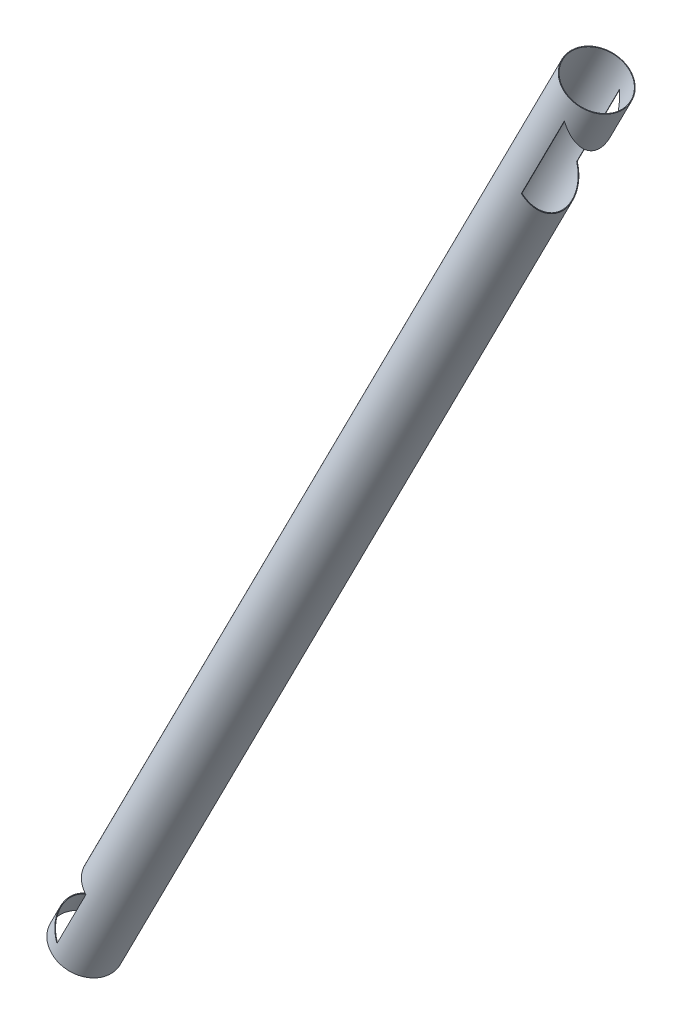
ISO-10303-21;
HEADER;
FILE_DESCRIPTION(('STEP AP214'),'2;1');
FILE_NAME('part.step','',(''),(''),'','','');
FILE_SCHEMA(('AUTOMOTIVE_DESIGN { 1 0 10303 214 1 1 1 1 }'));
ENDSEC;
DATA;
#1=APPLICATION_CONTEXT('core data for automotive mechanical design processes');
#2=APPLICATION_PROTOCOL_DEFINITION('international standard','automotive_design',2000,#1);
#3=PRODUCT_CONTEXT('',#1,'mechanical');
#4=PRODUCT('Part','Part','',(#3));
#5=PRODUCT_RELATED_PRODUCT_CATEGORY('part','',(#4));
#6=PRODUCT_DEFINITION_FORMATION('','',#4);
#7=PRODUCT_DEFINITION_CONTEXT('part definition',#1,'design');
#8=PRODUCT_DEFINITION('design','',#6,#7);
#9=PRODUCT_DEFINITION_SHAPE('','',#8);
#10=(LENGTH_UNIT() NAMED_UNIT(*) SI_UNIT(.MILLI.,.METRE.));
#11=(NAMED_UNIT(*) PLANE_ANGLE_UNIT() SI_UNIT($,.RADIAN.));
#12=(NAMED_UNIT(*) SI_UNIT($,.STERADIAN.) SOLID_ANGLE_UNIT());
#13=UNCERTAINTY_MEASURE_WITH_UNIT(LENGTH_MEASURE(1.E-05),#10,'distance_accuracy_value','');
#14=(GEOMETRIC_REPRESENTATION_CONTEXT(3) GLOBAL_UNCERTAINTY_ASSIGNED_CONTEXT((#13)) GLOBAL_UNIT_ASSIGNED_CONTEXT((#10,
#11,#12)) REPRESENTATION_CONTEXT('',''));
#15=CARTESIAN_POINT('',(0.,0.,0.));
#16=DIRECTION('',(0.,0.,1.));
#17=DIRECTION('',(1.,0.,0.));
#18=AXIS2_PLACEMENT_3D('',#15,#16,#17);
#19=CARTESIAN_POINT('',(1815.96199895819,3564.02609675347,0.));
#20=DIRECTION('',(0.453990499739548,0.891006524188367,0.));
#21=DIRECTION('',(-0.891006524188367,0.453990499739548,0.));
#22=AXIS2_PLACEMENT_3D('',#19,#20,#21);
#23=PLANE('',#22);
#24=CARTESIAN_POINT('',(1815.96199895819,3564.02609675347,0.));
#25=DIRECTION('',(0.453990499739548,0.891006524188367,0.));
#26=DIRECTION('',(-0.891006524188367,0.453990499739548,0.));
#27=AXIS2_PLACEMENT_3D('',#24,#25,#26);
#28=CIRCLE('',#27,102.);
#29=CARTESIAN_POINT('',(1725.07933349098,3610.3331277269,0.));
#30=VERTEX_POINT('',#29);
#31=EDGE_CURVE('E166',#30,#30,#28,.T.);
#32=ORIENTED_EDGE('',*,*,#31,.T.);
#33=EDGE_LOOP('',(#32));
#34=FACE_BOUND('',#33,.T.);
#35=CARTESIAN_POINT('',(1815.96199895819,3564.02609675347,0.));
#36=DIRECTION('',(0.453990499739548,0.891006524188367,0.));
#37=DIRECTION('',(-0.891006524188367,0.453990499739548,0.));
#38=AXIS2_PLACEMENT_3D('',#35,#36,#37);
#39=CIRCLE('',#38,100.);
#40=CARTESIAN_POINT('',(1726.86134653935,3609.42514672742,0.));
#41=VERTEX_POINT('',#40);
#42=EDGE_CURVE('E160',#41,#41,#39,.T.);
#43=ORIENTED_EDGE('',*,*,#42,.F.);
#44=EDGE_LOOP('',(#43));
#45=FACE_BOUND('',#44,.T.);
#46=ADVANCED_FACE('F55',(#34,#45),#23,.T.);
#47=CARTESIAN_POINT('',(0.,0.,0.));
#48=DIRECTION('',(0.453990499739548,0.891006524188367,0.));
#49=DIRECTION('',(-0.891006524188367,0.453990499739548,0.));
#50=AXIS2_PLACEMENT_3D('',#47,#48,#49);
#51=PLANE('',#50);
#52=CARTESIAN_POINT('',(0.,0.,0.));
#53=DIRECTION('',(0.453990499739548,0.891006524188367,0.));
#54=DIRECTION('',(-0.891006524188367,0.453990499739548,0.));
#55=AXIS2_PLACEMENT_3D('',#52,#53,#54);
#56=CIRCLE('',#55,102.);
#57=CARTESIAN_POINT('',(-90.8826654672135,46.3070309734339,0.));
#58=VERTEX_POINT('',#57);
#59=EDGE_CURVE('E163',#58,#58,#56,.T.);
#60=ORIENTED_EDGE('',*,*,#59,.F.);
#61=EDGE_LOOP('',(#60));
#62=FACE_BOUND('',#61,.T.);
#63=CARTESIAN_POINT('',(0.,0.,0.));
#64=DIRECTION('',(0.453990499739548,0.891006524188367,0.));
#65=DIRECTION('',(-0.891006524188367,0.453990499739548,0.));
#66=AXIS2_PLACEMENT_3D('',#63,#64,#65);
#67=CIRCLE('',#66,100.);
#68=CARTESIAN_POINT('',(-89.1006524188367,45.3990499739548,0.));
#69=VERTEX_POINT('',#68);
#70=EDGE_CURVE('E159',#69,#69,#67,.T.);
#71=ORIENTED_EDGE('',*,*,#70,.T.);
#72=EDGE_LOOP('',(#71));
#73=FACE_BOUND('',#72,.T.);
#74=ADVANCED_FACE('F206',(#62,#73),#51,.F.);
#75=CARTESIAN_POINT('',(1815.96199895819,3564.02609675347,0.));
#76=DIRECTION('',(-0.453990499739548,-0.891006524188367,0.));
#77=DIRECTION('',(0.891006524188367,-0.453990499739548,0.));
#78=AXIS2_PLACEMENT_3D('',#75,#76,#77);
#79=CYLINDRICAL_SURFACE('',#78,102.);
#80=CARTESIAN_POINT('',(1791.89509429515,3516.79213682679,0.));
#81=DIRECTION('',(0.977585011989273,0.210541075170458,0.));
#82=DIRECTION('',(0.210541075170458,-0.977585011989273,0.));
#83=AXIS2_PLACEMENT_3D('',#80,#81,#82);
#84=ELLIPSE('',#83,161.543780860049,102.);
#85=CARTESIAN_POINT('',(1799.897824015,3479.63383589765,99.1362698511497));
#86=VERTEX_POINT('',#85);
#87=CARTESIAN_POINT('',(1799.897824015,3479.63383589765,-99.13626985115));
#88=VERTEX_POINT('',#87);
#89=EDGE_CURVE('E126',#86,#88,#84,.T.);
#90=ORIENTED_EDGE('',*,*,#89,.T.);
#91=DIRECTION('',(-0.453990499739548,-0.891006524188367,0.));
#92=VECTOR('',#91,1.);
#93=CARTESIAN_POINT('',(1837.34615553871,3553.13032475972,-99.1362698511499));
#94=LINE('',#93,#92);
#95=CARTESIAN_POINT('',(1647.60708736431,3180.74643625588,-99.13626985115));
#96=VERTEX_POINT('',#95);
#97=EDGE_CURVE('E133',#88,#96,#94,.T.);
#98=ORIENTED_EDGE('',*,*,#97,.T.);
#99=CARTESIAN_POINT('',(1632.97481507119,3204.89352728403,0.));
#100=DIRECTION('',(-0.855234381676339,-0.518241403593624,0.));
#101=DIRECTION('',(0.518241403593624,-0.85523438167634,0.));
#102=AXIS2_PLACEMENT_3D('',#99,#100,#101);
#103=ELLIPSE('',#102,119.996505131697,102.);
#104=CARTESIAN_POINT('',(1647.60708736431,3180.74643625588,99.1362698511497));
#105=VERTEX_POINT('',#104);
#106=EDGE_CURVE('E118',#96,#105,#103,.T.);
#107=ORIENTED_EDGE('',*,*,#106,.T.);
#108=DIRECTION('',(-0.453990499739548,-0.891006524188367,0.));
#109=VECTOR('',#108,1.);
#110=CARTESIAN_POINT('',(1837.34615553871,3553.13032475972,99.1362698511499));
#111=LINE('',#110,#109);
#112=EDGE_CURVE('E140',#105,#86,#111,.F.);
#113=ORIENTED_EDGE('',*,*,#112,.T.);
#114=EDGE_LOOP('',(#90,#98,#107,#113));
#115=FACE_BOUND('',#114,.T.);
#116=CARTESIAN_POINT('',(122.663003232666,240.739698781241,0.));
#117=DIRECTION('',(0.453990499739548,0.891006524188367,0.));
#118=DIRECTION('',(-0.891006524188367,0.453990499739548,0.));
#119=AXIS2_PLACEMENT_3D('',#116,#117,#118);
#120=CIRCLE('',#119,102.);
#121=CARTESIAN_POINT('',(101.278846652145,251.63547077499,-99.1362698511497));
#122=VERTEX_POINT('',#121);
#123=CARTESIAN_POINT('',(101.278846652145,251.63547077499,99.1362698511497));
#124=VERTEX_POINT('',#123);
#125=EDGE_CURVE('E157',#122,#124,#120,.T.);
#126=ORIENTED_EDGE('',*,*,#125,.T.);
#127=DIRECTION('',(-0.453990499739548,-0.891006524188367,0.));
#128=VECTOR('',#127,1.);
#129=CARTESIAN_POINT('',(1794.57784237767,3574.92186874722,99.1362698511497));
#130=LINE('',#129,#128);
#131=CARTESIAN_POINT('',(-1.43999708746469,50.0383889382912,99.1362698511499));
#132=VERTEX_POINT('',#131);
#133=EDGE_CURVE('E155',#124,#132,#130,.T.);
#134=ORIENTED_EDGE('',*,*,#133,.T.);
#135=CARTESIAN_POINT('',(14.6299364141214,28.7128669012269,0.));
#136=DIRECTION('',(-0.798635510047292,-0.60181502315205,0.));
#137=DIRECTION('',(0.60181502315205,-0.798635510047292,0.));
#138=AXIS2_PLACEMENT_3D('',#135,#136,#137);
#139=ELLIPSE('',#138,113.485397928469,102.);
#140=CARTESIAN_POINT('',(-1.43999708746469,50.0383889382912,-99.1362698511498));
#141=VERTEX_POINT('',#140);
#142=EDGE_CURVE('E78',#132,#141,#139,.T.);
#143=ORIENTED_EDGE('',*,*,#142,.T.);
#144=DIRECTION('',(-0.453990499739548,-0.891006524188367,0.));
#145=VECTOR('',#144,1.);
#146=CARTESIAN_POINT('',(1794.57784237767,3574.92186874722,-99.1362698511497));
#147=LINE('',#146,#145);
#148=EDGE_CURVE('E153',#141,#122,#147,.F.);
#149=ORIENTED_EDGE('',*,*,#148,.T.);
#150=EDGE_LOOP('',(#126,#134,#143,#149));
#151=FACE_BOUND('',#150,.T.);
#152=ORIENTED_EDGE('',*,*,#31,.F.);
#153=EDGE_LOOP('',(#152));
#154=FACE_BOUND('',#153,.T.);
#155=ORIENTED_EDGE('',*,*,#59,.T.);
#156=EDGE_LOOP('',(#155));
#157=FACE_BOUND('',#156,.T.);
#158=ADVANCED_FACE('F57',(#115,#151,#154,#157),#79,.T.);
#159=CARTESIAN_POINT('',(1815.96199895819,3564.02609675347,0.));
#160=DIRECTION('',(-0.453990499739548,-0.891006524188367,0.));
#161=DIRECTION('',(0.891006524188367,-0.453990499739548,0.));
#162=AXIS2_PLACEMENT_3D('',#159,#160,#161);
#163=CYLINDRICAL_SURFACE('',#162,100.);
#164=CARTESIAN_POINT('',(1791.89509429515,3516.79213682679,0.));
#165=DIRECTION('',(0.977585011989273,0.210541075170458,0.));
#166=DIRECTION('',(0.210541075170458,-0.977585011989273,0.));
#167=AXIS2_PLACEMENT_3D('',#164,#165,#166);
#168=ELLIPSE('',#167,158.376255745146,100.);
#169=CARTESIAN_POINT('',(1799.897824015,3479.63383589765,97.0772887960927));
#170=VERTEX_POINT('',#169);
#171=CARTESIAN_POINT('',(1799.897824015,3479.63383589765,-97.077288796093));
#172=VERTEX_POINT('',#171);
#173=EDGE_CURVE('E13',#170,#172,#168,.T.);
#174=ORIENTED_EDGE('',*,*,#173,.F.);
#175=DIRECTION('',(-0.453990499739548,-0.891006524188367,0.));
#176=VECTOR('',#175,1.);
#177=CARTESIAN_POINT('',(1837.34615553871,3553.13032475972,97.0772887960928));
#178=LINE('',#177,#176);
#179=CARTESIAN_POINT('',(1647.60708736431,3180.74643625588,97.0772887960926));
#180=VERTEX_POINT('',#179);
#181=EDGE_CURVE('E182',#180,#170,#178,.F.);
#182=ORIENTED_EDGE('',*,*,#181,.F.);
#183=CARTESIAN_POINT('',(1632.97481507119,3204.89352728403,0.));
#184=DIRECTION('',(-0.855234381676339,-0.518241403593624,0.));
#185=DIRECTION('',(0.518241403593624,-0.85523438167634,0.));
#186=AXIS2_PLACEMENT_3D('',#183,#184,#185);
#187=ELLIPSE('',#186,117.643632482056,100.);
#188=CARTESIAN_POINT('',(1647.60708736431,3180.74643625588,-97.077288796093));
#189=VERTEX_POINT('',#188);
#190=EDGE_CURVE('E180',#189,#180,#187,.T.);
#191=ORIENTED_EDGE('',*,*,#190,.F.);
#192=DIRECTION('',(-0.453990499739548,-0.891006524188367,0.));
#193=VECTOR('',#192,1.);
#194=CARTESIAN_POINT('',(1837.34615553871,3553.13032475972,-97.0772887960928));
#195=LINE('',#194,#193);
#196=EDGE_CURVE('E63',#172,#189,#195,.T.);
#197=ORIENTED_EDGE('',*,*,#196,.F.);
#198=EDGE_LOOP('',(#174,#182,#191,#197));
#199=FACE_BOUND('',#198,.T.);
#200=CARTESIAN_POINT('',(122.663003232666,240.739698781241,0.));
#201=DIRECTION('',(0.453990499739548,0.891006524188367,0.));
#202=DIRECTION('',(-0.891006524188367,0.453990499739548,0.));
#203=AXIS2_PLACEMENT_3D('',#200,#201,#202);
#204=CIRCLE('',#203,100.);
#205=CARTESIAN_POINT('',(101.278846652145,251.63547077499,-97.0772887960926));
#206=VERTEX_POINT('',#205);
#207=CARTESIAN_POINT('',(101.278846652145,251.63547077499,97.0772887960927));
#208=VERTEX_POINT('',#207);
#209=EDGE_CURVE('E178',#206,#208,#204,.T.);
#210=ORIENTED_EDGE('',*,*,#209,.F.);
#211=DIRECTION('',(-0.453990499739548,-0.891006524188367,0.));
#212=VECTOR('',#211,1.);
#213=CARTESIAN_POINT('',(1794.57784237767,3574.92186874722,-97.0772887960926));
#214=LINE('',#213,#212);
#215=CARTESIAN_POINT('',(-1.43999708746469,50.0383889382912,-97.0772887960928));
#216=VERTEX_POINT('',#215);
#217=EDGE_CURVE('E173',#216,#206,#214,.F.);
#218=ORIENTED_EDGE('',*,*,#217,.F.);
#219=CARTESIAN_POINT('',(14.6299364141214,28.7128669012269,0.));
#220=DIRECTION('',(-0.798635510047292,-0.60181502315205,0.));
#221=DIRECTION('',(0.60181502315205,-0.798635510047292,0.));
#222=AXIS2_PLACEMENT_3D('',#219,#220,#221);
#223=ELLIPSE('',#222,111.260194047519,100.);
#224=CARTESIAN_POINT('',(-1.43999708746469,50.0383889382912,97.0772887960928));
#225=VERTEX_POINT('',#224);
#226=EDGE_CURVE('E169',#225,#216,#223,.T.);
#227=ORIENTED_EDGE('',*,*,#226,.F.);
#228=DIRECTION('',(-0.453990499739548,-0.891006524188367,0.));
#229=VECTOR('',#228,1.);
#230=CARTESIAN_POINT('',(1794.57784237767,3574.92186874722,97.0772887960926));
#231=LINE('',#230,#229);
#232=EDGE_CURVE('E175',#208,#225,#231,.T.);
#233=ORIENTED_EDGE('',*,*,#232,.F.);
#234=EDGE_LOOP('',(#210,#218,#227,#233));
#235=FACE_BOUND('',#234,.T.);
#236=ORIENTED_EDGE('',*,*,#42,.T.);
#237=EDGE_LOOP('',(#236));
#238=FACE_BOUND('',#237,.T.);
#239=ORIENTED_EDGE('',*,*,#70,.F.);
#240=EDGE_LOOP('',(#239));
#241=FACE_BOUND('',#240,.T.);
#242=ADVANCED_FACE('F193',(#199,#235,#238,#241),#163,.F.);
#243=CARTESIAN_POINT('',(101.278846652145,251.63547077499,-335.570225957941));
#244=DIRECTION('',(0.453990499739548,0.891006524188367,0.));
#245=DIRECTION('',(-0.891006524188367,0.453990499739548,0.));
#246=AXIS2_PLACEMENT_3D('',#243,#244,#245);
#247=PLANE('',#246);
#248=ORIENTED_EDGE('',*,*,#125,.F.);
#249=DIRECTION('',(0.,0.,1.));
#250=VECTOR('',#249,1.);
#251=CARTESIAN_POINT('',(101.278846652145,251.63547077499,-335.570225957941));
#252=LINE('',#251,#250);
#253=EDGE_CURVE('E150',#122,#206,#252,.T.);
#254=ORIENTED_EDGE('',*,*,#253,.T.);
#255=ORIENTED_EDGE('',*,*,#209,.T.);
#256=EDGE_CURVE('E148',#208,#124,#252,.T.);
#257=ORIENTED_EDGE('',*,*,#256,.T.);
#258=EDGE_LOOP('',(#248,#254,#255,#257));
#259=FACE_BOUND('',#258,.T.);
#260=ADVANCED_FACE('F196',(#259),#247,.F.);
#261=CARTESIAN_POINT('',(-1.43999708746469,50.0383889382912,-335.570225957941));
#262=DIRECTION('',(0.891006524188367,-0.453990499739548,0.));
#263=DIRECTION('',(0.453990499739548,0.891006524188367,0.));
#264=AXIS2_PLACEMENT_3D('',#261,#262,#263);
#265=PLANE('',#264);
#266=ORIENTED_EDGE('',*,*,#256,.F.);
#267=ORIENTED_EDGE('',*,*,#232,.T.);
#268=DIRECTION('',(0.,0.,1.));
#269=VECTOR('',#268,1.);
#270=CARTESIAN_POINT('',(-1.43999708746469,50.0383889382912,-335.570225957941));
#271=LINE('',#270,#269);
#272=EDGE_CURVE('E139',#225,#132,#271,.T.);
#273=ORIENTED_EDGE('',*,*,#272,.T.);
#274=ORIENTED_EDGE('',*,*,#133,.F.);
#275=EDGE_LOOP('',(#266,#267,#273,#274));
#276=FACE_BOUND('',#275,.T.);
#277=ADVANCED_FACE('F222',(#276),#265,.F.);
#278=EDGE_CURVE('E143',#141,#216,#271,.T.);
#279=ORIENTED_EDGE('',*,*,#278,.T.);
#280=ORIENTED_EDGE('',*,*,#217,.T.);
#281=ORIENTED_EDGE('',*,*,#253,.F.);
#282=ORIENTED_EDGE('',*,*,#148,.F.);
#283=EDGE_LOOP('',(#279,#280,#281,#282));
#284=FACE_BOUND('',#283,.T.);
#285=ADVANCED_FACE('F220',(#284),#265,.F.);
#286=CARTESIAN_POINT('',(-53.6672809676197,119.34633555875,-335.570225957941));
#287=DIRECTION('',(-0.798635510047292,-0.60181502315205,0.));
#288=DIRECTION('',(0.60181502315205,-0.798635510047292,0.));
#289=AXIS2_PLACEMENT_3D('',#286,#287,#288);
#290=PLANE('',#289);
#291=ORIENTED_EDGE('',*,*,#272,.F.);
#292=ORIENTED_EDGE('',*,*,#226,.T.);
#293=ORIENTED_EDGE('',*,*,#278,.F.);
#294=ORIENTED_EDGE('',*,*,#142,.F.);
#295=EDGE_LOOP('',(#291,#292,#293,#294));
#296=FACE_BOUND('',#295,.T.);
#297=ADVANCED_FACE('F217',(#296),#290,.F.);
#298=CARTESIAN_POINT('',(1799.897824015,3479.63383589765,-335.570225957941));
#299=DIRECTION('',(-0.891006524188368,0.453990499739547,0.));
#300=DIRECTION('',(-0.453990499739547,-0.891006524188368,0.));
#301=AXIS2_PLACEMENT_3D('',#298,#299,#300);
#302=PLANE('',#301);
#303=DIRECTION('',(0.,0.,1.));
#304=VECTOR('',#303,1.);
#305=CARTESIAN_POINT('',(1799.897824015,3479.63383589765,-335.570225957941));
#306=LINE('',#305,#304);
#307=EDGE_CURVE('E127',#88,#172,#306,.T.);
#308=ORIENTED_EDGE('',*,*,#307,.T.);
#309=ORIENTED_EDGE('',*,*,#196,.T.);
#310=DIRECTION('',(0.,0.,1.));
#311=VECTOR('',#310,1.);
#312=CARTESIAN_POINT('',(1647.60708736431,3180.74643625588,-335.570225957941));
#313=LINE('',#312,#311);
#314=EDGE_CURVE('E70',#96,#189,#313,.T.);
#315=ORIENTED_EDGE('',*,*,#314,.F.);
#316=ORIENTED_EDGE('',*,*,#97,.F.);
#317=EDGE_LOOP('',(#308,#309,#315,#316));
#318=FACE_BOUND('',#317,.T.);
#319=ADVANCED_FACE('F132',(#318),#302,.F.);
#320=EDGE_CURVE('E121',#180,#105,#313,.T.);
#321=ORIENTED_EDGE('',*,*,#320,.F.);
#322=ORIENTED_EDGE('',*,*,#181,.T.);
#323=EDGE_CURVE('E137',#170,#86,#306,.T.);
#324=ORIENTED_EDGE('',*,*,#323,.T.);
#325=ORIENTED_EDGE('',*,*,#112,.F.);
#326=EDGE_LOOP('',(#321,#322,#324,#325));
#327=FACE_BOUND('',#326,.T.);
#328=ADVANCED_FACE('F187',(#327),#302,.F.);
#329=CARTESIAN_POINT('',(1825.90669560452,3358.86935787793,-335.570225957941));
#330=DIRECTION('',(0.977585011989273,0.210541075170458,0.));
#331=DIRECTION('',(-0.210541075170458,0.977585011989273,0.));
#332=AXIS2_PLACEMENT_3D('',#329,#330,#331);
#333=PLANE('',#332);
#334=ORIENTED_EDGE('',*,*,#89,.F.);
#335=ORIENTED_EDGE('',*,*,#323,.F.);
#336=ORIENTED_EDGE('',*,*,#173,.T.);
#337=ORIENTED_EDGE('',*,*,#307,.F.);
#338=EDGE_LOOP('',(#334,#335,#336,#337));
#339=FACE_BOUND('',#338,.T.);
#340=ADVANCED_FACE('F191',(#339),#333,.F.);
#341=CARTESIAN_POINT('',(1647.60708736431,3180.74643625588,-335.570225957941));
#342=DIRECTION('',(-0.855234381676339,-0.518241403593624,0.));
#343=DIRECTION('',(0.518241403593624,-0.85523438167634,0.));
#344=AXIS2_PLACEMENT_3D('',#341,#342,#343);
#345=PLANE('',#344);
#346=ORIENTED_EDGE('',*,*,#106,.F.);
#347=ORIENTED_EDGE('',*,*,#314,.T.);
#348=ORIENTED_EDGE('',*,*,#190,.T.);
#349=ORIENTED_EDGE('',*,*,#320,.T.);
#350=EDGE_LOOP('',(#346,#347,#348,#349));
#351=FACE_BOUND('',#350,.T.);
#352=ADVANCED_FACE('F119',(#351),#345,.F.);
#353=CLOSED_SHELL('',(#46,#74,#158,#242,#260,#277,#285,#297,#319,#328,#340,#352));
#354=MANIFOLD_SOLID_BREP('B2',#353);
#355=ADVANCED_BREP_SHAPE_REPRESENTATION('',(#18,#354),#14);
#356=SHAPE_DEFINITION_REPRESENTATION(#9,#355);
ENDSEC;
END-ISO-10303-21;
